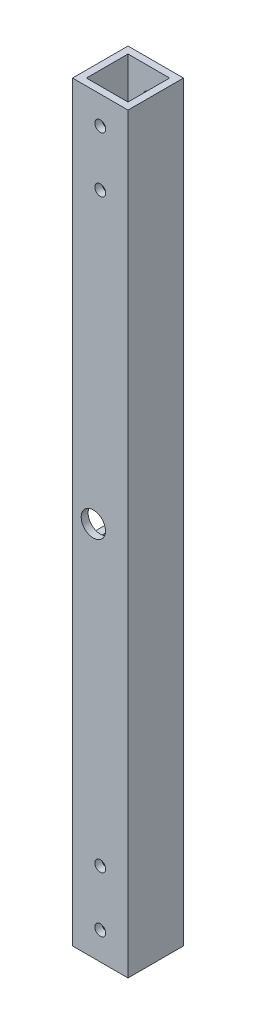
ISO-10303-21;
HEADER;
FILE_DESCRIPTION(('STEP AP214'),'2;1');
FILE_NAME('part.step','',(''),(''),'','','');
FILE_SCHEMA(('AUTOMOTIVE_DESIGN { 1 0 10303 214 1 1 1 1 }'));
ENDSEC;
DATA;
#1=APPLICATION_CONTEXT('core data for automotive mechanical design processes');
#2=APPLICATION_PROTOCOL_DEFINITION('international standard','automotive_design',2000,#1);
#3=PRODUCT_CONTEXT('',#1,'mechanical');
#4=PRODUCT('Part','Part','',(#3));
#5=PRODUCT_RELATED_PRODUCT_CATEGORY('part','',(#4));
#6=PRODUCT_DEFINITION_FORMATION('','',#4);
#7=PRODUCT_DEFINITION_CONTEXT('part definition',#1,'design');
#8=PRODUCT_DEFINITION('design','',#6,#7);
#9=PRODUCT_DEFINITION_SHAPE('','',#8);
#10=(LENGTH_UNIT() NAMED_UNIT(*) SI_UNIT(.MILLI.,.METRE.));
#11=(NAMED_UNIT(*) PLANE_ANGLE_UNIT() SI_UNIT($,.RADIAN.));
#12=(NAMED_UNIT(*) SI_UNIT($,.STERADIAN.) SOLID_ANGLE_UNIT());
#13=UNCERTAINTY_MEASURE_WITH_UNIT(LENGTH_MEASURE(1.E-05),#10,'distance_accuracy_value','');
#14=(GEOMETRIC_REPRESENTATION_CONTEXT(3) GLOBAL_UNCERTAINTY_ASSIGNED_CONTEXT((#13)) GLOBAL_UNIT_ASSIGNED_CONTEXT((#10,
#11,#12)) REPRESENTATION_CONTEXT('',''));
#15=CARTESIAN_POINT('',(0.,0.,0.));
#16=DIRECTION('',(0.,0.,1.));
#17=DIRECTION('',(1.,0.,0.));
#18=AXIS2_PLACEMENT_3D('',#15,#16,#17);
#19=CARTESIAN_POINT('',(25.4,172.085,-12.7));
#20=DIRECTION('',(0.,0.,1.));
#21=DIRECTION('',(1.,0.,0.));
#22=AXIS2_PLACEMENT_3D('',#19,#20,#21);
#23=PLANE('',#22);
#24=CARTESIAN_POINT('',(12.7,-159.385,-12.7));
#25=DIRECTION('',(0.,0.,-1.));
#26=DIRECTION('',(-1.,0.,0.));
#27=AXIS2_PLACEMENT_3D('',#24,#25,#26);
#28=CIRCLE('',#27,2.48920000000001);
#29=CARTESIAN_POINT('',(10.2108,-159.385,-12.7));
#30=VERTEX_POINT('',#29);
#31=EDGE_CURVE('E326',#30,#30,#28,.T.);
#32=ORIENTED_EDGE('',*,*,#31,.F.);
#33=EDGE_LOOP('',(#32));
#34=FACE_BOUND('',#33,.T.);
#35=CARTESIAN_POINT('',(12.7,-133.985,-12.7));
#36=DIRECTION('',(0.,0.,-1.));
#37=DIRECTION('',(-1.,0.,0.));
#38=AXIS2_PLACEMENT_3D('',#35,#36,#37);
#39=CIRCLE('',#38,2.4892);
#40=CARTESIAN_POINT('',(10.2108,-133.985,-12.7));
#41=VERTEX_POINT('',#40);
#42=EDGE_CURVE('E320',#41,#41,#39,.T.);
#43=ORIENTED_EDGE('',*,*,#42,.F.);
#44=EDGE_LOOP('',(#43));
#45=FACE_BOUND('',#44,.T.);
#46=CARTESIAN_POINT('',(9.525,0.,-12.7));
#47=DIRECTION('',(0.,0.,-1.));
#48=DIRECTION('',(-1.,0.,0.));
#49=AXIS2_PLACEMENT_3D('',#46,#47,#48);
#50=CIRCLE('',#49,5.55625);
#51=CARTESIAN_POINT('',(3.96875,0.,-12.7));
#52=VERTEX_POINT('',#51);
#53=EDGE_CURVE('E314',#52,#52,#50,.T.);
#54=ORIENTED_EDGE('',*,*,#53,.F.);
#55=EDGE_LOOP('',(#54));
#56=FACE_BOUND('',#55,.T.);
#57=DIRECTION('',(-1.,0.,0.));
#58=VECTOR('',#57,1.);
#59=CARTESIAN_POINT('',(25.4,-172.085,-12.7));
#60=LINE('',#59,#58);
#61=CARTESIAN_POINT('',(25.4,-172.085,-12.7));
#62=VERTEX_POINT('',#61);
#63=CARTESIAN_POINT('',(0.,-172.085,-12.7));
#64=VERTEX_POINT('',#63);
#65=EDGE_CURVE('E213',#62,#64,#60,.T.);
#66=ORIENTED_EDGE('',*,*,#65,.T.);
#67=DIRECTION('',(0.,-1.,0.));
#68=VECTOR('',#67,1.);
#69=CARTESIAN_POINT('',(0.,172.085,-12.7));
#70=LINE('',#69,#68);
#71=CARTESIAN_POINT('',(0.,172.085,-12.7));
#72=VERTEX_POINT('',#71);
#73=EDGE_CURVE('E223',#72,#64,#70,.T.);
#74=ORIENTED_EDGE('',*,*,#73,.F.);
#75=DIRECTION('',(-1.,0.,0.));
#76=VECTOR('',#75,1.);
#77=CARTESIAN_POINT('',(25.4,172.085,-12.7));
#78=LINE('',#77,#76);
#79=CARTESIAN_POINT('',(25.4,172.085,-12.7));
#80=VERTEX_POINT('',#79);
#81=EDGE_CURVE('E203',#80,#72,#78,.T.);
#82=ORIENTED_EDGE('',*,*,#81,.F.);
#83=DIRECTION('',(0.,-1.,0.));
#84=VECTOR('',#83,1.);
#85=CARTESIAN_POINT('',(25.4,172.085,-12.7));
#86=LINE('',#85,#84);
#87=EDGE_CURVE('E226',#80,#62,#86,.T.);
#88=ORIENTED_EDGE('',*,*,#87,.T.);
#89=EDGE_LOOP('',(#66,#74,#82,#88));
#90=FACE_BOUND('',#89,.T.);
#91=CARTESIAN_POINT('',(12.7,133.985,-12.7));
#92=DIRECTION('',(0.,0.,1.));
#93=DIRECTION('',(-1.,0.,0.));
#94=AXIS2_PLACEMENT_3D('',#91,#92,#93);
#95=CIRCLE('',#94,2.4892);
#96=CARTESIAN_POINT('',(10.2108,133.985,-12.7));
#97=VERTEX_POINT('',#96);
#98=EDGE_CURVE('E335',#97,#97,#95,.T.);
#99=ORIENTED_EDGE('',*,*,#98,.T.);
#100=EDGE_LOOP('',(#99));
#101=FACE_BOUND('',#100,.T.);
#102=CARTESIAN_POINT('',(12.7,159.385,-12.7));
#103=DIRECTION('',(0.,0.,1.));
#104=DIRECTION('',(-1.,0.,0.));
#105=AXIS2_PLACEMENT_3D('',#102,#103,#104);
#106=CIRCLE('',#105,2.48920000000001);
#107=CARTESIAN_POINT('',(10.2108,159.385,-12.7));
#108=VERTEX_POINT('',#107);
#109=EDGE_CURVE('E341',#108,#108,#106,.T.);
#110=ORIENTED_EDGE('',*,*,#109,.T.);
#111=EDGE_LOOP('',(#110));
#112=FACE_BOUND('',#111,.T.);
#113=ADVANCED_FACE('F34',(#34,#45,#56,#90,#101,#112),#23,.F.);
#114=CARTESIAN_POINT('',(0.,172.085,12.7));
#115=DIRECTION('',(0.,0.,-1.));
#116=DIRECTION('',(-1.,0.,0.));
#117=AXIS2_PLACEMENT_3D('',#114,#115,#116);
#118=PLANE('',#117);
#119=CARTESIAN_POINT('',(12.7,-159.385,12.7));
#120=DIRECTION('',(0.,0.,-1.));
#121=DIRECTION('',(-1.,0.,0.));
#122=AXIS2_PLACEMENT_3D('',#119,#120,#121);
#123=CIRCLE('',#122,2.48920000000001);
#124=CARTESIAN_POINT('',(10.2108,-159.385,12.7));
#125=VERTEX_POINT('',#124);
#126=EDGE_CURVE('E234',#125,#125,#123,.T.);
#127=ORIENTED_EDGE('',*,*,#126,.T.);
#128=EDGE_LOOP('',(#127));
#129=FACE_BOUND('',#128,.T.);
#130=CARTESIAN_POINT('',(12.7,-133.985,12.7));
#131=DIRECTION('',(0.,0.,-1.));
#132=DIRECTION('',(-1.,0.,0.));
#133=AXIS2_PLACEMENT_3D('',#130,#131,#132);
#134=CIRCLE('',#133,2.4892);
#135=CARTESIAN_POINT('',(10.2108,-133.985,12.7));
#136=VERTEX_POINT('',#135);
#137=EDGE_CURVE('E323',#136,#136,#134,.T.);
#138=ORIENTED_EDGE('',*,*,#137,.T.);
#139=EDGE_LOOP('',(#138));
#140=FACE_BOUND('',#139,.T.);
#141=CARTESIAN_POINT('',(9.52500000000001,0.,12.7));
#142=DIRECTION('',(0.,0.,-1.));
#143=DIRECTION('',(-1.,0.,0.));
#144=AXIS2_PLACEMENT_3D('',#141,#142,#143);
#145=CIRCLE('',#144,5.55625);
#146=CARTESIAN_POINT('',(3.96875000000001,0.,12.7));
#147=VERTEX_POINT('',#146);
#148=EDGE_CURVE('E317',#147,#147,#145,.T.);
#149=ORIENTED_EDGE('',*,*,#148,.T.);
#150=EDGE_LOOP('',(#149));
#151=FACE_BOUND('',#150,.T.);
#152=DIRECTION('',(1.,0.,0.));
#153=VECTOR('',#152,1.);
#154=CARTESIAN_POINT('',(0.,-172.085,12.7));
#155=LINE('',#154,#153);
#156=CARTESIAN_POINT('',(0.,-172.085,12.7));
#157=VERTEX_POINT('',#156);
#158=CARTESIAN_POINT('',(25.4,-172.085,12.7));
#159=VERTEX_POINT('',#158);
#160=EDGE_CURVE('E204',#157,#159,#155,.T.);
#161=ORIENTED_EDGE('',*,*,#160,.T.);
#162=DIRECTION('',(0.,-1.,0.));
#163=VECTOR('',#162,1.);
#164=CARTESIAN_POINT('',(25.4,172.085,12.7));
#165=LINE('',#164,#163);
#166=CARTESIAN_POINT('',(25.4,172.085,12.7));
#167=VERTEX_POINT('',#166);
#168=EDGE_CURVE('E210',#167,#159,#165,.T.);
#169=ORIENTED_EDGE('',*,*,#168,.F.);
#170=DIRECTION('',(1.,0.,0.));
#171=VECTOR('',#170,1.);
#172=CARTESIAN_POINT('',(0.,172.085,12.7));
#173=LINE('',#172,#171);
#174=CARTESIAN_POINT('',(0.,172.085,12.7));
#175=VERTEX_POINT('',#174);
#176=EDGE_CURVE('E208',#175,#167,#173,.T.);
#177=ORIENTED_EDGE('',*,*,#176,.F.);
#178=DIRECTION('',(0.,-1.,0.));
#179=VECTOR('',#178,1.);
#180=CARTESIAN_POINT('',(0.,172.085,12.7));
#181=LINE('',#180,#179);
#182=EDGE_CURVE('E220',#175,#157,#181,.T.);
#183=ORIENTED_EDGE('',*,*,#182,.T.);
#184=EDGE_LOOP('',(#161,#169,#177,#183));
#185=FACE_BOUND('',#184,.T.);
#186=CARTESIAN_POINT('',(12.7,133.985,12.7));
#187=DIRECTION('',(0.,0.,1.));
#188=DIRECTION('',(-1.,0.,0.));
#189=AXIS2_PLACEMENT_3D('',#186,#187,#188);
#190=CIRCLE('',#189,2.4892);
#191=CARTESIAN_POINT('',(10.2108,133.985,12.7));
#192=VERTEX_POINT('',#191);
#193=EDGE_CURVE('E338',#192,#192,#190,.T.);
#194=ORIENTED_EDGE('',*,*,#193,.F.);
#195=EDGE_LOOP('',(#194));
#196=FACE_BOUND('',#195,.T.);
#197=CARTESIAN_POINT('',(12.7,159.385,12.7));
#198=DIRECTION('',(0.,0.,1.));
#199=DIRECTION('',(-1.,0.,0.));
#200=AXIS2_PLACEMENT_3D('',#197,#198,#199);
#201=CIRCLE('',#200,2.48920000000001);
#202=CARTESIAN_POINT('',(10.2108,159.385,12.7));
#203=VERTEX_POINT('',#202);
#204=EDGE_CURVE('E247',#203,#203,#201,.T.);
#205=ORIENTED_EDGE('',*,*,#204,.F.);
#206=EDGE_LOOP('',(#205));
#207=FACE_BOUND('',#206,.T.);
#208=ADVANCED_FACE('F349',(#129,#140,#151,#185,#196,#207),#118,.F.);
#209=CARTESIAN_POINT('',(22.225,172.085,9.525));
#210=DIRECTION('',(0.,0.,-1.));
#211=DIRECTION('',(-1.,0.,0.));
#212=AXIS2_PLACEMENT_3D('',#209,#210,#211);
#213=PLANE('',#212);
#214=CARTESIAN_POINT('',(12.7,133.985,9.525));
#215=DIRECTION('',(0.,0.,-1.));
#216=DIRECTION('',(-1.,0.,0.));
#217=AXIS2_PLACEMENT_3D('',#214,#215,#216);
#218=CIRCLE('',#217,2.4892);
#219=CARTESIAN_POINT('',(10.2108,133.985,9.525));
#220=VERTEX_POINT('',#219);
#221=EDGE_CURVE('E246',#220,#220,#218,.F.);
#222=ORIENTED_EDGE('',*,*,#221,.T.);
#223=EDGE_LOOP('',(#222));
#224=FACE_BOUND('',#223,.T.);
#225=CARTESIAN_POINT('',(12.7,-159.385,9.525));
#226=DIRECTION('',(0.,0.,-1.));
#227=DIRECTION('',(-1.,0.,0.));
#228=AXIS2_PLACEMENT_3D('',#225,#226,#227);
#229=CIRCLE('',#228,2.48920000000001);
#230=CARTESIAN_POINT('',(10.2108,-159.385,9.525));
#231=VERTEX_POINT('',#230);
#232=EDGE_CURVE('E242',#231,#231,#229,.T.);
#233=ORIENTED_EDGE('',*,*,#232,.F.);
#234=EDGE_LOOP('',(#233));
#235=FACE_BOUND('',#234,.T.);
#236=CARTESIAN_POINT('',(12.7,-133.985,9.525));
#237=DIRECTION('',(0.,0.,-1.));
#238=DIRECTION('',(-1.,0.,0.));
#239=AXIS2_PLACEMENT_3D('',#236,#237,#238);
#240=CIRCLE('',#239,2.4892);
#241=CARTESIAN_POINT('',(10.2108,-133.985,9.525));
#242=VERTEX_POINT('',#241);
#243=EDGE_CURVE('E238',#242,#242,#240,.T.);
#244=ORIENTED_EDGE('',*,*,#243,.F.);
#245=EDGE_LOOP('',(#244));
#246=FACE_BOUND('',#245,.T.);
#247=CARTESIAN_POINT('',(9.52500000000001,0.,9.525));
#248=DIRECTION('',(0.,0.,-1.));
#249=DIRECTION('',(-1.,0.,0.));
#250=AXIS2_PLACEMENT_3D('',#247,#248,#249);
#251=CIRCLE('',#250,5.55625);
#252=CARTESIAN_POINT('',(3.96875000000001,0.,9.525));
#253=VERTEX_POINT('',#252);
#254=EDGE_CURVE('E233',#253,#253,#251,.T.);
#255=ORIENTED_EDGE('',*,*,#254,.F.);
#256=EDGE_LOOP('',(#255));
#257=FACE_BOUND('',#256,.T.);
#258=DIRECTION('',(0.,1.,0.));
#259=VECTOR('',#258,1.);
#260=CARTESIAN_POINT('',(0.,-12.7,9.525));
#261=LINE('',#260,#259);
#262=CARTESIAN_POINT('',(0.,-6.34999999999999,9.525));
#263=VERTEX_POINT('',#262);
#264=CARTESIAN_POINT('',(0.,6.35,9.525));
#265=VERTEX_POINT('',#264);
#266=EDGE_CURVE('E287',#263,#265,#261,.T.);
#267=ORIENTED_EDGE('',*,*,#266,.T.);
#268=DIRECTION('',(-1.,0.,0.));
#269=VECTOR('',#268,1.);
#270=CARTESIAN_POINT('',(22.225,6.34999999999999,9.525));
#271=LINE('',#270,#269);
#272=CARTESIAN_POINT('',(3.175,6.34999999999999,9.525));
#273=VERTEX_POINT('',#272);
#274=EDGE_CURVE('E167',#265,#273,#271,.F.);
#275=ORIENTED_EDGE('',*,*,#274,.T.);
#276=DIRECTION('',(0.,-1.,0.));
#277=VECTOR('',#276,1.);
#278=CARTESIAN_POINT('',(3.175,172.085,9.525));
#279=LINE('',#278,#277);
#280=CARTESIAN_POINT('',(3.175,172.085,9.525));
#281=VERTEX_POINT('',#280);
#282=EDGE_CURVE('E151',#281,#273,#279,.T.);
#283=ORIENTED_EDGE('',*,*,#282,.F.);
#284=DIRECTION('',(1.,0.,0.));
#285=VECTOR('',#284,1.);
#286=CARTESIAN_POINT('',(22.225,172.085,9.525));
#287=LINE('',#286,#285);
#288=CARTESIAN_POINT('',(22.225,172.085,9.525));
#289=VERTEX_POINT('',#288);
#290=EDGE_CURVE('E158',#281,#289,#287,.T.);
#291=ORIENTED_EDGE('',*,*,#290,.T.);
#292=DIRECTION('',(0.,-1.,0.));
#293=VECTOR('',#292,1.);
#294=CARTESIAN_POINT('',(22.225,172.085,9.525));
#295=LINE('',#294,#293);
#296=CARTESIAN_POINT('',(22.225,-172.085,9.525));
#297=VERTEX_POINT('',#296);
#298=EDGE_CURVE('E198',#289,#297,#295,.T.);
#299=ORIENTED_EDGE('',*,*,#298,.T.);
#300=DIRECTION('',(1.,0.,0.));
#301=VECTOR('',#300,1.);
#302=CARTESIAN_POINT('',(22.225,-172.085,9.525));
#303=LINE('',#302,#301);
#304=CARTESIAN_POINT('',(3.175,-172.085,9.525));
#305=VERTEX_POINT('',#304);
#306=EDGE_CURVE('E186',#305,#297,#303,.T.);
#307=ORIENTED_EDGE('',*,*,#306,.F.);
#308=CARTESIAN_POINT('',(3.175,-6.34999999999999,9.525));
#309=VERTEX_POINT('',#308);
#310=EDGE_CURVE('E170',#309,#305,#279,.T.);
#311=ORIENTED_EDGE('',*,*,#310,.F.);
#312=DIRECTION('',(-1.,0.,0.));
#313=VECTOR('',#312,1.);
#314=CARTESIAN_POINT('',(22.225,-6.34999999999999,9.525));
#315=LINE('',#314,#313);
#316=EDGE_CURVE('E256',#309,#263,#315,.T.);
#317=ORIENTED_EDGE('',*,*,#316,.T.);
#318=EDGE_LOOP('',(#267,#275,#283,#291,#299,#307,#311,#317));
#319=FACE_BOUND('',#318,.T.);
#320=CARTESIAN_POINT('',(12.7,159.385,9.525));
#321=DIRECTION('',(0.,0.,-1.));
#322=DIRECTION('',(-1.,0.,0.));
#323=AXIS2_PLACEMENT_3D('',#320,#321,#322);
#324=CIRCLE('',#323,2.48920000000001);
#325=CARTESIAN_POINT('',(10.2108,159.385,9.525));
#326=VERTEX_POINT('',#325);
#327=EDGE_CURVE('E251',#326,#326,#324,.F.);
#328=ORIENTED_EDGE('',*,*,#327,.T.);
#329=EDGE_LOOP('',(#328));
#330=FACE_BOUND('',#329,.T.);
#331=ADVANCED_FACE('F163',(#224,#235,#246,#257,#319,#330),#213,.T.);
#332=CARTESIAN_POINT('',(3.175,172.085,-9.525));
#333=DIRECTION('',(0.,0.,1.));
#334=DIRECTION('',(1.,0.,0.));
#335=AXIS2_PLACEMENT_3D('',#332,#333,#334);
#336=PLANE('',#335);
#337=CARTESIAN_POINT('',(12.7,133.985,-9.525));
#338=DIRECTION('',(0.,0.,1.));
#339=DIRECTION('',(1.,0.,0.));
#340=AXIS2_PLACEMENT_3D('',#337,#338,#339);
#341=CIRCLE('',#340,2.4892);
#342=CARTESIAN_POINT('',(15.1892,133.985,-9.525));
#343=VERTEX_POINT('',#342);
#344=EDGE_CURVE('E243',#343,#343,#341,.F.);
#345=ORIENTED_EDGE('',*,*,#344,.T.);
#346=EDGE_LOOP('',(#345));
#347=FACE_BOUND('',#346,.T.);
#348=CARTESIAN_POINT('',(12.7,-159.385,-9.525));
#349=DIRECTION('',(0.,0.,1.));
#350=DIRECTION('',(1.,0.,0.));
#351=AXIS2_PLACEMENT_3D('',#348,#349,#350);
#352=CIRCLE('',#351,2.48920000000001);
#353=CARTESIAN_POINT('',(15.1892,-159.385,-9.525));
#354=VERTEX_POINT('',#353);
#355=EDGE_CURVE('E239',#354,#354,#352,.T.);
#356=ORIENTED_EDGE('',*,*,#355,.F.);
#357=EDGE_LOOP('',(#356));
#358=FACE_BOUND('',#357,.T.);
#359=CARTESIAN_POINT('',(12.7,-133.985,-9.525));
#360=DIRECTION('',(0.,0.,1.));
#361=DIRECTION('',(1.,0.,0.));
#362=AXIS2_PLACEMENT_3D('',#359,#360,#361);
#363=CIRCLE('',#362,2.4892);
#364=CARTESIAN_POINT('',(15.1892,-133.985,-9.525));
#365=VERTEX_POINT('',#364);
#366=EDGE_CURVE('E235',#365,#365,#363,.T.);
#367=ORIENTED_EDGE('',*,*,#366,.F.);
#368=EDGE_LOOP('',(#367));
#369=FACE_BOUND('',#368,.T.);
#370=CARTESIAN_POINT('',(9.525,0.,-9.525));
#371=DIRECTION('',(0.,0.,1.));
#372=DIRECTION('',(1.,0.,0.));
#373=AXIS2_PLACEMENT_3D('',#370,#371,#372);
#374=CIRCLE('',#373,5.55625);
#375=CARTESIAN_POINT('',(15.08125,0.,-9.525));
#376=VERTEX_POINT('',#375);
#377=EDGE_CURVE('E230',#376,#376,#374,.T.);
#378=ORIENTED_EDGE('',*,*,#377,.F.);
#379=EDGE_LOOP('',(#378));
#380=FACE_BOUND('',#379,.T.);
#381=DIRECTION('',(0.,-1.,0.));
#382=VECTOR('',#381,1.);
#383=CARTESIAN_POINT('',(3.175,172.085,-9.525));
#384=LINE('',#383,#382);
#385=CARTESIAN_POINT('',(3.175,172.085,-9.525));
#386=VERTEX_POINT('',#385);
#387=CARTESIAN_POINT('',(3.175,6.34999999999999,-9.525));
#388=VERTEX_POINT('',#387);
#389=EDGE_CURVE('E154',#386,#388,#384,.T.);
#390=ORIENTED_EDGE('',*,*,#389,.T.);
#391=DIRECTION('',(-1.,0.,0.));
#392=VECTOR('',#391,1.);
#393=CARTESIAN_POINT('',(3.175,6.34999999999999,-9.525));
#394=LINE('',#393,#392);
#395=CARTESIAN_POINT('',(0.,6.35,-9.525));
#396=VERTEX_POINT('',#395);
#397=EDGE_CURVE('E263',#388,#396,#394,.T.);
#398=ORIENTED_EDGE('',*,*,#397,.T.);
#399=DIRECTION('',(0.,-1.,0.));
#400=VECTOR('',#399,1.);
#401=CARTESIAN_POINT('',(0.,-12.7,-9.525));
#402=LINE('',#401,#400);
#403=CARTESIAN_POINT('',(0.,-6.35,-9.525));
#404=VERTEX_POINT('',#403);
#405=EDGE_CURVE('E293',#396,#404,#402,.T.);
#406=ORIENTED_EDGE('',*,*,#405,.T.);
#407=DIRECTION('',(-1.,0.,0.));
#408=VECTOR('',#407,1.);
#409=CARTESIAN_POINT('',(3.175,-6.34999999999999,-9.525));
#410=LINE('',#409,#408);
#411=CARTESIAN_POINT('',(3.175,-6.34999999999999,-9.525));
#412=VERTEX_POINT('',#411);
#413=EDGE_CURVE('E260',#404,#412,#410,.F.);
#414=ORIENTED_EDGE('',*,*,#413,.T.);
#415=CARTESIAN_POINT('',(3.175,-172.085,-9.525));
#416=VERTEX_POINT('',#415);
#417=EDGE_CURVE('E182',#412,#416,#384,.T.);
#418=ORIENTED_EDGE('',*,*,#417,.T.);
#419=DIRECTION('',(-1.,0.,0.));
#420=VECTOR('',#419,1.);
#421=CARTESIAN_POINT('',(3.175,-172.085,-9.525));
#422=LINE('',#421,#420);
#423=CARTESIAN_POINT('',(22.225,-172.085,-9.525));
#424=VERTEX_POINT('',#423);
#425=EDGE_CURVE('E159',#424,#416,#422,.T.);
#426=ORIENTED_EDGE('',*,*,#425,.F.);
#427=DIRECTION('',(0.,-1.,0.));
#428=VECTOR('',#427,1.);
#429=CARTESIAN_POINT('',(22.225,172.085,-9.525));
#430=LINE('',#429,#428);
#431=CARTESIAN_POINT('',(22.225,172.085,-9.525));
#432=VERTEX_POINT('',#431);
#433=EDGE_CURVE('E196',#432,#424,#430,.T.);
#434=ORIENTED_EDGE('',*,*,#433,.F.);
#435=DIRECTION('',(-1.,0.,0.));
#436=VECTOR('',#435,1.);
#437=CARTESIAN_POINT('',(3.175,172.085,-9.525));
#438=LINE('',#437,#436);
#439=EDGE_CURVE('E177',#432,#386,#438,.T.);
#440=ORIENTED_EDGE('',*,*,#439,.T.);
#441=EDGE_LOOP('',(#390,#398,#406,#414,#418,#426,#434,#440));
#442=FACE_BOUND('',#441,.T.);
#443=CARTESIAN_POINT('',(12.7,159.385,-9.525));
#444=DIRECTION('',(0.,0.,1.));
#445=DIRECTION('',(1.,0.,0.));
#446=AXIS2_PLACEMENT_3D('',#443,#444,#445);
#447=CIRCLE('',#446,2.48920000000001);
#448=CARTESIAN_POINT('',(15.1892,159.385,-9.525));
#449=VERTEX_POINT('',#448);
#450=EDGE_CURVE('E248',#449,#449,#447,.F.);
#451=ORIENTED_EDGE('',*,*,#450,.T.);
#452=EDGE_LOOP('',(#451));
#453=FACE_BOUND('',#452,.T.);
#454=ADVANCED_FACE('F357',(#347,#358,#369,#380,#442,#453),#336,.T.);
#455=CARTESIAN_POINT('',(3.175,172.085,9.525));
#456=DIRECTION('',(1.,0.,0.));
#457=DIRECTION('',(0.,0.,-1.));
#458=AXIS2_PLACEMENT_3D('',#455,#456,#457);
#459=PLANE('',#458);
#460=ORIENTED_EDGE('',*,*,#282,.T.);
#461=CARTESIAN_POINT('',(3.175,6.35,3.175));
#462=DIRECTION('',(1.,0.,0.));
#463=DIRECTION('',(0.,0.,-1.));
#464=AXIS2_PLACEMENT_3D('',#461,#462,#463);
#465=CIRCLE('',#464,6.35);
#466=CARTESIAN_POINT('',(3.175,12.7,3.175));
#467=VERTEX_POINT('',#466);
#468=EDGE_CURVE('E272',#273,#467,#465,.F.);
#469=ORIENTED_EDGE('',*,*,#468,.T.);
#470=DIRECTION('',(0.,0.,-1.));
#471=VECTOR('',#470,1.);
#472=CARTESIAN_POINT('',(3.175,12.7,-9.525));
#473=LINE('',#472,#471);
#474=CARTESIAN_POINT('',(3.175,12.7,-3.175));
#475=VERTEX_POINT('',#474);
#476=EDGE_CURVE('E292',#467,#475,#473,.T.);
#477=ORIENTED_EDGE('',*,*,#476,.T.);
#478=CARTESIAN_POINT('',(3.175,6.34999999999999,-3.175));
#479=DIRECTION('',(1.,0.,0.));
#480=DIRECTION('',(0.,0.,-1.));
#481=AXIS2_PLACEMENT_3D('',#478,#479,#480);
#482=CIRCLE('',#481,6.35);
#483=EDGE_CURVE('E276',#475,#388,#482,.F.);
#484=ORIENTED_EDGE('',*,*,#483,.T.);
#485=ORIENTED_EDGE('',*,*,#389,.F.);
#486=DIRECTION('',(0.,0.,1.));
#487=VECTOR('',#486,1.);
#488=CARTESIAN_POINT('',(3.175,172.085,9.525));
#489=LINE('',#488,#487);
#490=EDGE_CURVE('E148',#386,#281,#489,.T.);
#491=ORIENTED_EDGE('',*,*,#490,.T.);
#492=EDGE_LOOP('',(#460,#469,#477,#484,#485,#491));
#493=FACE_BOUND('',#492,.T.);
#494=ADVANCED_FACE('F150',(#493),#459,.T.);
#495=CARTESIAN_POINT('',(0.,172.085,0.));
#496=DIRECTION('',(0.,1.,0.));
#497=DIRECTION('',(0.,0.,1.));
#498=AXIS2_PLACEMENT_3D('',#495,#496,#497);
#499=PLANE('',#498);
#500=DIRECTION('',(0.,0.,-1.));
#501=VECTOR('',#500,1.);
#502=CARTESIAN_POINT('',(25.4,172.085,-12.7));
#503=LINE('',#502,#501);
#504=EDGE_CURVE('E200',#167,#80,#503,.T.);
#505=ORIENTED_EDGE('',*,*,#504,.T.);
#506=ORIENTED_EDGE('',*,*,#81,.T.);
#507=DIRECTION('',(0.,0.,1.));
#508=VECTOR('',#507,1.);
#509=CARTESIAN_POINT('',(0.,172.085,-12.7));
#510=LINE('',#509,#508);
#511=EDGE_CURVE('E206',#72,#175,#510,.T.);
#512=ORIENTED_EDGE('',*,*,#511,.T.);
#513=ORIENTED_EDGE('',*,*,#176,.T.);
#514=EDGE_LOOP('',(#505,#506,#512,#513));
#515=FACE_BOUND('',#514,.T.);
#516=ORIENTED_EDGE('',*,*,#290,.F.);
#517=ORIENTED_EDGE('',*,*,#490,.F.);
#518=ORIENTED_EDGE('',*,*,#439,.F.);
#519=DIRECTION('',(0.,0.,-1.));
#520=VECTOR('',#519,1.);
#521=CARTESIAN_POINT('',(22.225,172.085,-9.525));
#522=LINE('',#521,#520);
#523=EDGE_CURVE('E175',#289,#432,#522,.T.);
#524=ORIENTED_EDGE('',*,*,#523,.F.);
#525=EDGE_LOOP('',(#516,#517,#518,#524));
#526=FACE_BOUND('',#525,.T.);
#527=ADVANCED_FACE('F173',(#515,#526),#499,.T.);
#528=CARTESIAN_POINT('',(0.,-172.085,0.));
#529=DIRECTION('',(0.,1.,0.));
#530=DIRECTION('',(0.,0.,1.));
#531=AXIS2_PLACEMENT_3D('',#528,#529,#530);
#532=PLANE('',#531);
#533=DIRECTION('',(0.,0.,-1.));
#534=VECTOR('',#533,1.);
#535=CARTESIAN_POINT('',(25.4,-172.085,-12.7));
#536=LINE('',#535,#534);
#537=EDGE_CURVE('E169',#159,#62,#536,.T.);
#538=ORIENTED_EDGE('',*,*,#537,.F.);
#539=ORIENTED_EDGE('',*,*,#160,.F.);
#540=DIRECTION('',(0.,0.,1.));
#541=VECTOR('',#540,1.);
#542=CARTESIAN_POINT('',(0.,-172.085,-12.7));
#543=LINE('',#542,#541);
#544=EDGE_CURVE('E215',#64,#157,#543,.T.);
#545=ORIENTED_EDGE('',*,*,#544,.F.);
#546=ORIENTED_EDGE('',*,*,#65,.F.);
#547=EDGE_LOOP('',(#538,#539,#545,#546));
#548=FACE_BOUND('',#547,.T.);
#549=DIRECTION('',(0.,0.,1.));
#550=VECTOR('',#549,1.);
#551=CARTESIAN_POINT('',(3.175,-172.085,9.525));
#552=LINE('',#551,#550);
#553=EDGE_CURVE('E183',#416,#305,#552,.T.);
#554=ORIENTED_EDGE('',*,*,#553,.T.);
#555=ORIENTED_EDGE('',*,*,#306,.T.);
#556=DIRECTION('',(0.,0.,-1.));
#557=VECTOR('',#556,1.);
#558=CARTESIAN_POINT('',(22.225,-172.085,-9.525));
#559=LINE('',#558,#557);
#560=EDGE_CURVE('E190',#297,#424,#559,.T.);
#561=ORIENTED_EDGE('',*,*,#560,.T.);
#562=ORIENTED_EDGE('',*,*,#425,.T.);
#563=EDGE_LOOP('',(#554,#555,#561,#562));
#564=FACE_BOUND('',#563,.T.);
#565=ADVANCED_FACE('F365',(#548,#564),#532,.F.);
#566=CARTESIAN_POINT('',(25.4,172.085,-12.7));
#567=DIRECTION('',(-1.,0.,0.));
#568=DIRECTION('',(0.,0.,1.));
#569=AXIS2_PLACEMENT_3D('',#566,#567,#568);
#570=PLANE('',#569);
#571=ORIENTED_EDGE('',*,*,#537,.T.);
#572=ORIENTED_EDGE('',*,*,#87,.F.);
#573=ORIENTED_EDGE('',*,*,#504,.F.);
#574=ORIENTED_EDGE('',*,*,#168,.T.);
#575=EDGE_LOOP('',(#571,#572,#573,#574));
#576=FACE_BOUND('',#575,.T.);
#577=ADVANCED_FACE('F368',(#576),#570,.F.);
#578=CARTESIAN_POINT('',(0.,172.085,-12.7));
#579=DIRECTION('',(1.,0.,0.));
#580=DIRECTION('',(0.,0.,-1.));
#581=AXIS2_PLACEMENT_3D('',#578,#579,#580);
#582=PLANE('',#581);
#583=ORIENTED_EDGE('',*,*,#405,.F.);
#584=CARTESIAN_POINT('',(0.,6.34999999999999,-3.175));
#585=DIRECTION('',(1.,0.,0.));
#586=DIRECTION('',(0.,0.,-1.));
#587=AXIS2_PLACEMENT_3D('',#584,#585,#586);
#588=CIRCLE('',#587,6.35);
#589=CARTESIAN_POINT('',(0.,12.7,-3.17500000000001));
#590=VERTEX_POINT('',#589);
#591=EDGE_CURVE('E274',#396,#590,#588,.T.);
#592=ORIENTED_EDGE('',*,*,#591,.T.);
#593=DIRECTION('',(0.,0.,-1.));
#594=VECTOR('',#593,1.);
#595=CARTESIAN_POINT('',(0.,12.7,-9.525));
#596=LINE('',#595,#594);
#597=CARTESIAN_POINT('',(0.,12.7,3.17499999999999));
#598=VERTEX_POINT('',#597);
#599=EDGE_CURVE('E303',#598,#590,#596,.T.);
#600=ORIENTED_EDGE('',*,*,#599,.F.);
#601=CARTESIAN_POINT('',(0.,6.35,3.175));
#602=DIRECTION('',(1.,0.,0.));
#603=DIRECTION('',(0.,0.,-1.));
#604=AXIS2_PLACEMENT_3D('',#601,#602,#603);
#605=CIRCLE('',#604,6.35);
#606=EDGE_CURVE('E270',#598,#265,#605,.T.);
#607=ORIENTED_EDGE('',*,*,#606,.T.);
#608=ORIENTED_EDGE('',*,*,#266,.F.);
#609=CARTESIAN_POINT('',(0.,-6.34999999999999,3.175));
#610=DIRECTION('',(1.,0.,0.));
#611=DIRECTION('',(0.,0.,-1.));
#612=AXIS2_PLACEMENT_3D('',#609,#610,#611);
#613=CIRCLE('',#612,6.35);
#614=CARTESIAN_POINT('',(0.,-12.7,3.17499999999999));
#615=VERTEX_POINT('',#614);
#616=EDGE_CURVE('E42',#263,#615,#613,.T.);
#617=ORIENTED_EDGE('',*,*,#616,.T.);
#618=DIRECTION('',(0.,0.,1.));
#619=VECTOR('',#618,1.);
#620=CARTESIAN_POINT('',(0.,-12.7,-9.525));
#621=LINE('',#620,#619);
#622=CARTESIAN_POINT('',(0.,-12.7,-3.17500000000001));
#623=VERTEX_POINT('',#622);
#624=EDGE_CURVE('E286',#623,#615,#621,.T.);
#625=ORIENTED_EDGE('',*,*,#624,.F.);
#626=CARTESIAN_POINT('',(0.,-6.35,-3.175));
#627=DIRECTION('',(1.,0.,0.));
#628=DIRECTION('',(0.,0.,-1.));
#629=AXIS2_PLACEMENT_3D('',#626,#627,#628);
#630=CIRCLE('',#629,6.35);
#631=EDGE_CURVE('E278',#623,#404,#630,.T.);
#632=ORIENTED_EDGE('',*,*,#631,.T.);
#633=EDGE_LOOP('',(#583,#592,#600,#607,#608,#617,#625,#632));
#634=FACE_BOUND('',#633,.T.);
#635=ORIENTED_EDGE('',*,*,#544,.T.);
#636=ORIENTED_EDGE('',*,*,#182,.F.);
#637=ORIENTED_EDGE('',*,*,#511,.F.);
#638=ORIENTED_EDGE('',*,*,#73,.T.);
#639=EDGE_LOOP('',(#635,#636,#637,#638));
#640=FACE_BOUND('',#639,.T.);
#641=ADVANCED_FACE('F284',(#634,#640),#582,.F.);
#642=ORIENTED_EDGE('',*,*,#417,.F.);
#643=CARTESIAN_POINT('',(3.175,-6.35,-3.175));
#644=DIRECTION('',(1.,0.,0.));
#645=DIRECTION('',(0.,0.,-1.));
#646=AXIS2_PLACEMENT_3D('',#643,#644,#645);
#647=CIRCLE('',#646,6.35);
#648=CARTESIAN_POINT('',(3.175,-12.7,-3.175));
#649=VERTEX_POINT('',#648);
#650=EDGE_CURVE('E56',#412,#649,#647,.F.);
#651=ORIENTED_EDGE('',*,*,#650,.T.);
#652=DIRECTION('',(0.,0.,1.));
#653=VECTOR('',#652,1.);
#654=CARTESIAN_POINT('',(3.175,-12.7,-9.525));
#655=LINE('',#654,#653);
#656=CARTESIAN_POINT('',(3.175,-12.7,3.175));
#657=VERTEX_POINT('',#656);
#658=EDGE_CURVE('E187',#649,#657,#655,.T.);
#659=ORIENTED_EDGE('',*,*,#658,.T.);
#660=CARTESIAN_POINT('',(3.175,-6.34999999999999,3.175));
#661=DIRECTION('',(1.,0.,0.));
#662=DIRECTION('',(0.,0.,-1.));
#663=AXIS2_PLACEMENT_3D('',#660,#661,#662);
#664=CIRCLE('',#663,6.35);
#665=EDGE_CURVE('E11',#657,#309,#664,.F.);
#666=ORIENTED_EDGE('',*,*,#665,.T.);
#667=ORIENTED_EDGE('',*,*,#310,.T.);
#668=ORIENTED_EDGE('',*,*,#553,.F.);
#669=EDGE_LOOP('',(#642,#651,#659,#666,#667,#668));
#670=FACE_BOUND('',#669,.T.);
#671=ADVANCED_FACE('F296',(#670),#459,.T.);
#672=CARTESIAN_POINT('',(22.225,172.085,-9.525));
#673=DIRECTION('',(-1.,0.,0.));
#674=DIRECTION('',(0.,0.,1.));
#675=AXIS2_PLACEMENT_3D('',#672,#673,#674);
#676=PLANE('',#675);
#677=ORIENTED_EDGE('',*,*,#560,.F.);
#678=ORIENTED_EDGE('',*,*,#298,.F.);
#679=ORIENTED_EDGE('',*,*,#523,.T.);
#680=ORIENTED_EDGE('',*,*,#433,.T.);
#681=EDGE_LOOP('',(#677,#678,#679,#680));
#682=FACE_BOUND('',#681,.T.);
#683=ADVANCED_FACE('F401',(#682),#676,.T.);
#684=CARTESIAN_POINT('',(34.925,12.7,-9.525));
#685=DIRECTION('',(0.,1.,0.));
#686=DIRECTION('',(0.,0.,1.));
#687=AXIS2_PLACEMENT_3D('',#684,#685,#686);
#688=PLANE('',#687);
#689=ORIENTED_EDGE('',*,*,#476,.F.);
#690=DIRECTION('',(-1.,0.,0.));
#691=VECTOR('',#690,1.);
#692=CARTESIAN_POINT('',(34.925,12.7,3.175));
#693=LINE('',#692,#691);
#694=EDGE_CURVE('E253',#467,#598,#693,.T.);
#695=ORIENTED_EDGE('',*,*,#694,.T.);
#696=ORIENTED_EDGE('',*,*,#599,.T.);
#697=DIRECTION('',(-1.,0.,0.));
#698=VECTOR('',#697,1.);
#699=CARTESIAN_POINT('',(34.925,12.7,-3.17499999999999));
#700=LINE('',#699,#698);
#701=EDGE_CURVE('E229',#590,#475,#700,.F.);
#702=ORIENTED_EDGE('',*,*,#701,.T.);
#703=EDGE_LOOP('',(#689,#695,#696,#702));
#704=FACE_BOUND('',#703,.T.);
#705=ADVANCED_FACE('F395',(#704),#688,.F.);
#706=CARTESIAN_POINT('',(34.925,-12.7,-9.525));
#707=DIRECTION('',(0.,-1.,0.));
#708=DIRECTION('',(0.,0.,-1.));
#709=AXIS2_PLACEMENT_3D('',#706,#707,#708);
#710=PLANE('',#709);
#711=ORIENTED_EDGE('',*,*,#658,.F.);
#712=DIRECTION('',(-1.,0.,0.));
#713=VECTOR('',#712,1.);
#714=CARTESIAN_POINT('',(34.925,-12.7,-3.17499999999999));
#715=LINE('',#714,#713);
#716=EDGE_CURVE('E267',#649,#623,#715,.T.);
#717=ORIENTED_EDGE('',*,*,#716,.T.);
#718=ORIENTED_EDGE('',*,*,#624,.T.);
#719=DIRECTION('',(-1.,0.,0.));
#720=VECTOR('',#719,1.);
#721=CARTESIAN_POINT('',(34.925,-12.7,3.175));
#722=LINE('',#721,#720);
#723=EDGE_CURVE('E49',#615,#657,#722,.F.);
#724=ORIENTED_EDGE('',*,*,#723,.T.);
#725=EDGE_LOOP('',(#711,#717,#718,#724));
#726=FACE_BOUND('',#725,.T.);
#727=ADVANCED_FACE('F290',(#726),#710,.F.);
#728=CARTESIAN_POINT('',(9.52500000000001,0.,12.7));
#729=DIRECTION('',(0.,0.,-1.));
#730=DIRECTION('',(-1.,0.,0.));
#731=AXIS2_PLACEMENT_3D('',#728,#729,#730);
#732=CYLINDRICAL_SURFACE('',#731,5.55625);
#733=ORIENTED_EDGE('',*,*,#377,.T.);
#734=EDGE_LOOP('',(#733));
#735=FACE_BOUND('',#734,.T.);
#736=ORIENTED_EDGE('',*,*,#53,.T.);
#737=EDGE_LOOP('',(#736));
#738=FACE_BOUND('',#737,.T.);
#739=ADVANCED_FACE('F473',(#735,#738),#732,.F.);
#740=CARTESIAN_POINT('',(12.7,-133.985,12.7));
#741=DIRECTION('',(0.,0.,-1.));
#742=DIRECTION('',(-1.,0.,0.));
#743=AXIS2_PLACEMENT_3D('',#740,#741,#742);
#744=CYLINDRICAL_SURFACE('',#743,2.4892);
#745=ORIENTED_EDGE('',*,*,#366,.T.);
#746=EDGE_LOOP('',(#745));
#747=FACE_BOUND('',#746,.T.);
#748=ORIENTED_EDGE('',*,*,#42,.T.);
#749=EDGE_LOOP('',(#748));
#750=FACE_BOUND('',#749,.T.);
#751=ADVANCED_FACE('F476',(#747,#750),#744,.F.);
#752=CARTESIAN_POINT('',(12.7,-159.385,12.7));
#753=DIRECTION('',(0.,0.,-1.));
#754=DIRECTION('',(-1.,0.,0.));
#755=AXIS2_PLACEMENT_3D('',#752,#753,#754);
#756=CYLINDRICAL_SURFACE('',#755,2.48920000000001);
#757=ORIENTED_EDGE('',*,*,#355,.T.);
#758=EDGE_LOOP('',(#757));
#759=FACE_BOUND('',#758,.T.);
#760=ORIENTED_EDGE('',*,*,#31,.T.);
#761=EDGE_LOOP('',(#760));
#762=FACE_BOUND('',#761,.T.);
#763=ADVANCED_FACE('F457',(#759,#762),#756,.F.);
#764=ORIENTED_EDGE('',*,*,#254,.T.);
#765=EDGE_LOOP('',(#764));
#766=FACE_BOUND('',#765,.T.);
#767=ORIENTED_EDGE('',*,*,#148,.F.);
#768=EDGE_LOOP('',(#767));
#769=FACE_BOUND('',#768,.T.);
#770=ADVANCED_FACE('F478',(#766,#769),#732,.F.);
#771=ORIENTED_EDGE('',*,*,#243,.T.);
#772=EDGE_LOOP('',(#771));
#773=FACE_BOUND('',#772,.T.);
#774=ORIENTED_EDGE('',*,*,#137,.F.);
#775=EDGE_LOOP('',(#774));
#776=FACE_BOUND('',#775,.T.);
#777=ADVANCED_FACE('F455',(#773,#776),#744,.F.);
#778=ORIENTED_EDGE('',*,*,#232,.T.);
#779=EDGE_LOOP('',(#778));
#780=FACE_BOUND('',#779,.T.);
#781=ORIENTED_EDGE('',*,*,#126,.F.);
#782=EDGE_LOOP('',(#781));
#783=FACE_BOUND('',#782,.T.);
#784=ADVANCED_FACE('F450',(#780,#783),#756,.F.);
#785=CARTESIAN_POINT('',(12.7,133.985,12.7));
#786=DIRECTION('',(0.,0.,-1.));
#787=DIRECTION('',(-1.,0.,0.));
#788=AXIS2_PLACEMENT_3D('',#785,#786,#787);
#789=CYLINDRICAL_SURFACE('',#788,2.4892);
#790=ORIENTED_EDGE('',*,*,#344,.F.);
#791=EDGE_LOOP('',(#790));
#792=FACE_BOUND('',#791,.T.);
#793=ORIENTED_EDGE('',*,*,#98,.F.);
#794=EDGE_LOOP('',(#793));
#795=FACE_BOUND('',#794,.T.);
#796=ADVANCED_FACE('F439',(#792,#795),#789,.F.);
#797=CARTESIAN_POINT('',(12.7,159.385,12.7));
#798=DIRECTION('',(0.,0.,-1.));
#799=DIRECTION('',(-1.,0.,0.));
#800=AXIS2_PLACEMENT_3D('',#797,#798,#799);
#801=CYLINDRICAL_SURFACE('',#800,2.48920000000001);
#802=ORIENTED_EDGE('',*,*,#450,.F.);
#803=EDGE_LOOP('',(#802));
#804=FACE_BOUND('',#803,.T.);
#805=ORIENTED_EDGE('',*,*,#109,.F.);
#806=EDGE_LOOP('',(#805));
#807=FACE_BOUND('',#806,.T.);
#808=ADVANCED_FACE('F436',(#804,#807),#801,.F.);
#809=ORIENTED_EDGE('',*,*,#221,.F.);
#810=EDGE_LOOP('',(#809));
#811=FACE_BOUND('',#810,.T.);
#812=ORIENTED_EDGE('',*,*,#193,.T.);
#813=EDGE_LOOP('',(#812));
#814=FACE_BOUND('',#813,.T.);
#815=ADVANCED_FACE('F434',(#811,#814),#789,.F.);
#816=ORIENTED_EDGE('',*,*,#327,.F.);
#817=EDGE_LOOP('',(#816));
#818=FACE_BOUND('',#817,.T.);
#819=ORIENTED_EDGE('',*,*,#204,.T.);
#820=EDGE_LOOP('',(#819));
#821=FACE_BOUND('',#820,.T.);
#822=ADVANCED_FACE('F347',(#818,#821),#801,.F.);
#823=CARTESIAN_POINT('',(34.925,6.35,3.175));
#824=DIRECTION('',(-1.,0.,0.));
#825=DIRECTION('',(0.,0.,1.));
#826=AXIS2_PLACEMENT_3D('',#823,#824,#825);
#827=CYLINDRICAL_SURFACE('',#826,6.35);
#828=ORIENTED_EDGE('',*,*,#468,.F.);
#829=ORIENTED_EDGE('',*,*,#274,.F.);
#830=ORIENTED_EDGE('',*,*,#606,.F.);
#831=ORIENTED_EDGE('',*,*,#694,.F.);
#832=EDGE_LOOP('',(#828,#829,#830,#831));
#833=FACE_BOUND('',#832,.T.);
#834=ADVANCED_FACE('F373',(#833),#827,.F.);
#835=CARTESIAN_POINT('',(3.175,6.34999999999999,-3.175));
#836=DIRECTION('',(-1.,0.,0.));
#837=DIRECTION('',(0.,0.,1.));
#838=AXIS2_PLACEMENT_3D('',#835,#836,#837);
#839=CYLINDRICAL_SURFACE('',#838,6.35);
#840=ORIENTED_EDGE('',*,*,#483,.F.);
#841=ORIENTED_EDGE('',*,*,#701,.F.);
#842=ORIENTED_EDGE('',*,*,#591,.F.);
#843=ORIENTED_EDGE('',*,*,#397,.F.);
#844=EDGE_LOOP('',(#840,#841,#842,#843));
#845=FACE_BOUND('',#844,.T.);
#846=ADVANCED_FACE('F376',(#845),#839,.F.);
#847=CARTESIAN_POINT('',(34.925,-6.35,-3.17499999999999));
#848=DIRECTION('',(-1.,0.,0.));
#849=DIRECTION('',(0.,0.,1.));
#850=AXIS2_PLACEMENT_3D('',#847,#848,#849);
#851=CYLINDRICAL_SURFACE('',#850,6.35);
#852=ORIENTED_EDGE('',*,*,#650,.F.);
#853=ORIENTED_EDGE('',*,*,#413,.F.);
#854=ORIENTED_EDGE('',*,*,#631,.F.);
#855=ORIENTED_EDGE('',*,*,#716,.F.);
#856=EDGE_LOOP('',(#852,#853,#854,#855));
#857=FACE_BOUND('',#856,.T.);
#858=ADVANCED_FACE('F379',(#857),#851,.F.);
#859=CARTESIAN_POINT('',(22.225,-6.34999999999999,3.175));
#860=DIRECTION('',(-1.,0.,0.));
#861=DIRECTION('',(0.,0.,1.));
#862=AXIS2_PLACEMENT_3D('',#859,#860,#861);
#863=CYLINDRICAL_SURFACE('',#862,6.35);
#864=ORIENTED_EDGE('',*,*,#665,.F.);
#865=ORIENTED_EDGE('',*,*,#723,.F.);
#866=ORIENTED_EDGE('',*,*,#616,.F.);
#867=ORIENTED_EDGE('',*,*,#316,.F.);
#868=EDGE_LOOP('',(#864,#865,#866,#867));
#869=FACE_BOUND('',#868,.T.);
#870=ADVANCED_FACE('F36',(#869),#863,.F.);
#871=CLOSED_SHELL('',(#113,#208,#331,#454,#494,#527,#565,#577,#641,#671,#683,#705,#727,#739,
#751,#763,#770,#777,#784,#796,#808,#815,#822,#834,#846,#858,#870));
#872=MANIFOLD_SOLID_BREP('B2',#871);
#873=ADVANCED_BREP_SHAPE_REPRESENTATION('',(#18,#872),#14);
#874=SHAPE_DEFINITION_REPRESENTATION(#9,#873);
ENDSEC;
END-ISO-10303-21;
